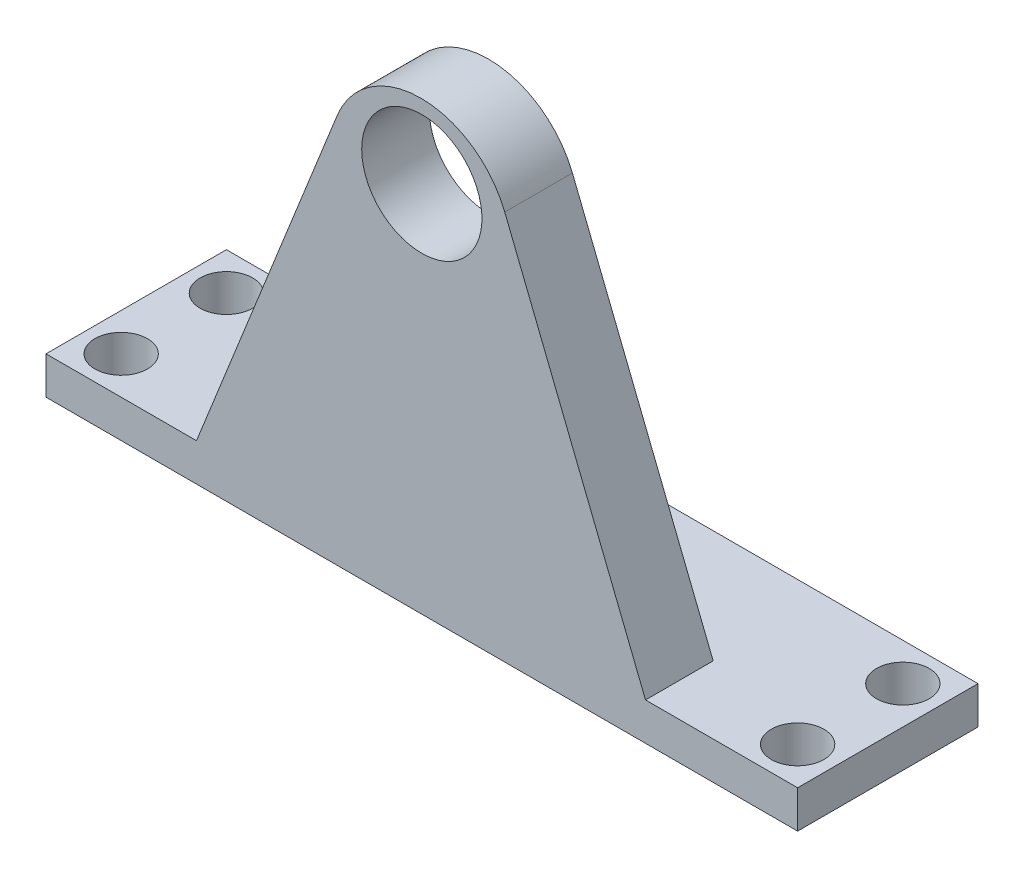
ISO-10303-21;
HEADER;
FILE_DESCRIPTION(('STEP AP214'),'2;1');
FILE_NAME('part.step','',(''),(''),'','','');
FILE_SCHEMA(('AUTOMOTIVE_DESIGN { 1 0 10303 214 1 1 1 1 }'));
ENDSEC;
DATA;
#1=APPLICATION_CONTEXT('core data for automotive mechanical design processes');
#2=APPLICATION_PROTOCOL_DEFINITION('international standard','automotive_design',2000,#1);
#3=PRODUCT_CONTEXT('',#1,'mechanical');
#4=PRODUCT('Part','Part','',(#3));
#5=PRODUCT_RELATED_PRODUCT_CATEGORY('part','',(#4));
#6=PRODUCT_DEFINITION_FORMATION('','',#4);
#7=PRODUCT_DEFINITION_CONTEXT('part definition',#1,'design');
#8=PRODUCT_DEFINITION('design','',#6,#7);
#9=PRODUCT_DEFINITION_SHAPE('','',#8);
#10=(LENGTH_UNIT() NAMED_UNIT(*) SI_UNIT(.MILLI.,.METRE.));
#11=(NAMED_UNIT(*) PLANE_ANGLE_UNIT() SI_UNIT($,.RADIAN.));
#12=(NAMED_UNIT(*) SI_UNIT($,.STERADIAN.) SOLID_ANGLE_UNIT());
#13=UNCERTAINTY_MEASURE_WITH_UNIT(LENGTH_MEASURE(1.E-05),#10,'distance_accuracy_value','');
#14=(GEOMETRIC_REPRESENTATION_CONTEXT(3) GLOBAL_UNCERTAINTY_ASSIGNED_CONTEXT((#13)) GLOBAL_UNIT_ASSIGNED_CONTEXT((#10,
#11,#12)) REPRESENTATION_CONTEXT('',''));
#15=CARTESIAN_POINT('',(0.,0.,0.));
#16=DIRECTION('',(0.,0.,1.));
#17=DIRECTION('',(1.,0.,0.));
#18=AXIS2_PLACEMENT_3D('',#15,#16,#17);
#19=CARTESIAN_POINT('',(0.,5.,0.));
#20=DIRECTION('',(0.,1.,0.));
#21=DIRECTION('',(0.,0.,1.));
#22=AXIS2_PLACEMENT_3D('',#19,#20,#21);
#23=PLANE('',#22);
#24=DIRECTION('',(0.,0.,-1.));
#25=VECTOR('',#24,1.);
#26=CARTESIAN_POINT('',(29.7635160139142,5.,12.));
#27=LINE('',#26,#25);
#28=CARTESIAN_POINT('',(29.7635160139142,5.,12.));
#29=VERTEX_POINT('',#28);
#30=CARTESIAN_POINT('',(29.7635160139142,5.,3.));
#31=VERTEX_POINT('',#30);
#32=EDGE_CURVE('E123',#29,#31,#27,.T.);
#33=ORIENTED_EDGE('',*,*,#32,.F.);
#34=DIRECTION('',(1.,0.,0.));
#35=VECTOR('',#34,1.);
#36=CARTESIAN_POINT('',(-50.,5.,12.));
#37=LINE('',#36,#35);
#38=CARTESIAN_POINT('',(50.,5.,12.));
#39=VERTEX_POINT('',#38);
#40=EDGE_CURVE('E131',#29,#39,#37,.T.);
#41=ORIENTED_EDGE('',*,*,#40,.T.);
#42=DIRECTION('',(0.,0.,-1.));
#43=VECTOR('',#42,1.);
#44=CARTESIAN_POINT('',(50.,5.,-12.));
#45=LINE('',#44,#43);
#46=CARTESIAN_POINT('',(50.,5.,-12.));
#47=VERTEX_POINT('',#46);
#48=EDGE_CURVE('E130',#39,#47,#45,.T.);
#49=ORIENTED_EDGE('',*,*,#48,.T.);
#50=DIRECTION('',(-1.,0.,0.));
#51=VECTOR('',#50,1.);
#52=CARTESIAN_POINT('',(-50.,5.,-12.));
#53=LINE('',#52,#51);
#54=CARTESIAN_POINT('',(-50.,5.,-12.));
#55=VERTEX_POINT('',#54);
#56=EDGE_CURVE('E60',#47,#55,#53,.T.);
#57=ORIENTED_EDGE('',*,*,#56,.T.);
#58=DIRECTION('',(0.,0.,1.));
#59=VECTOR('',#58,1.);
#60=CARTESIAN_POINT('',(-50.,5.,-12.));
#61=LINE('',#60,#59);
#62=CARTESIAN_POINT('',(-50.,5.,12.));
#63=VERTEX_POINT('',#62);
#64=EDGE_CURVE('E128',#55,#63,#61,.T.);
#65=ORIENTED_EDGE('',*,*,#64,.T.);
#66=CARTESIAN_POINT('',(-29.9780216951291,5.,12.));
#67=VERTEX_POINT('',#66);
#68=EDGE_CURVE('E88',#63,#67,#37,.T.);
#69=ORIENTED_EDGE('',*,*,#68,.T.);
#70=DIRECTION('',(0.,0.,-1.));
#71=VECTOR('',#70,1.);
#72=CARTESIAN_POINT('',(-29.9780216951291,5.,12.));
#73=LINE('',#72,#71);
#74=CARTESIAN_POINT('',(-29.9780216951291,5.,3.));
#75=VERTEX_POINT('',#74);
#76=EDGE_CURVE('E119',#67,#75,#73,.T.);
#77=ORIENTED_EDGE('',*,*,#76,.T.);
#78=DIRECTION('',(1.,0.,0.));
#79=VECTOR('',#78,1.);
#80=CARTESIAN_POINT('',(-29.9780216951291,5.,3.));
#81=LINE('',#80,#79);
#82=EDGE_CURVE('E227',#75,#31,#81,.T.);
#83=ORIENTED_EDGE('',*,*,#82,.T.);
#84=EDGE_LOOP('',(#33,#41,#49,#57,#65,#69,#77,#83));
#85=FACE_BOUND('',#84,.T.);
#86=CARTESIAN_POINT('',(44.9999999999999,5.,-7.00000000000003));
#87=DIRECTION('',(0.,1.,0.));
#88=DIRECTION('',(0.,0.,-1.));
#89=AXIS2_PLACEMENT_3D('',#86,#87,#88);
#90=CIRCLE('',#89,3.5);
#91=CARTESIAN_POINT('',(44.9999999999999,5.,-10.5));
#92=VERTEX_POINT('',#91);
#93=EDGE_CURVE('E258',#92,#92,#90,.T.);
#94=ORIENTED_EDGE('',*,*,#93,.F.);
#95=EDGE_LOOP('',(#94));
#96=FACE_BOUND('',#95,.T.);
#97=CARTESIAN_POINT('',(-45.,5.,-7.));
#98=DIRECTION('',(0.,1.,0.));
#99=DIRECTION('',(0.,0.,1.));
#100=AXIS2_PLACEMENT_3D('',#97,#98,#99);
#101=CIRCLE('',#100,3.5);
#102=CARTESIAN_POINT('',(-45.,5.,-3.5));
#103=VERTEX_POINT('',#102);
#104=EDGE_CURVE('E148',#103,#103,#101,.T.);
#105=ORIENTED_EDGE('',*,*,#104,.F.);
#106=EDGE_LOOP('',(#105));
#107=FACE_BOUND('',#106,.T.);
#108=CARTESIAN_POINT('',(-45.,5.,7.));
#109=DIRECTION('',(0.,1.,0.));
#110=DIRECTION('',(0.,0.,1.));
#111=AXIS2_PLACEMENT_3D('',#108,#109,#110);
#112=CIRCLE('',#111,3.5);
#113=CARTESIAN_POINT('',(-45.,5.,10.5));
#114=VERTEX_POINT('',#113);
#115=EDGE_CURVE('E264',#114,#114,#112,.T.);
#116=ORIENTED_EDGE('',*,*,#115,.F.);
#117=EDGE_LOOP('',(#116));
#118=FACE_BOUND('',#117,.T.);
#119=CARTESIAN_POINT('',(45.,5.,6.99999999999997));
#120=DIRECTION('',(0.,1.,0.));
#121=DIRECTION('',(0.,0.,-1.));
#122=AXIS2_PLACEMENT_3D('',#119,#120,#121);
#123=CIRCLE('',#122,3.5);
#124=CARTESIAN_POINT('',(45.,5.,3.49999999999997));
#125=VERTEX_POINT('',#124);
#126=EDGE_CURVE('E243',#125,#125,#123,.T.);
#127=ORIENTED_EDGE('',*,*,#126,.F.);
#128=EDGE_LOOP('',(#127));
#129=FACE_BOUND('',#128,.T.);
#130=ADVANCED_FACE('F34',(#85,#96,#107,#118,#129),#23,.T.);
#131=CARTESIAN_POINT('',(0.,0.,0.));
#132=DIRECTION('',(0.,1.,0.));
#133=DIRECTION('',(0.,0.,1.));
#134=AXIS2_PLACEMENT_3D('',#131,#132,#133);
#135=PLANE('',#134);
#136=CARTESIAN_POINT('',(44.9999999999999,0.,-7.00000000000003));
#137=DIRECTION('',(0.,1.,0.));
#138=DIRECTION('',(0.,0.,-1.));
#139=AXIS2_PLACEMENT_3D('',#136,#137,#138);
#140=CIRCLE('',#139,3.5);
#141=CARTESIAN_POINT('',(44.9999999999999,0.,-10.5));
#142=VERTEX_POINT('',#141);
#143=EDGE_CURVE('E255',#142,#142,#140,.T.);
#144=ORIENTED_EDGE('',*,*,#143,.T.);
#145=EDGE_LOOP('',(#144));
#146=FACE_BOUND('',#145,.T.);
#147=CARTESIAN_POINT('',(-45.,0.,-7.));
#148=DIRECTION('',(0.,1.,0.));
#149=DIRECTION('',(0.,0.,1.));
#150=AXIS2_PLACEMENT_3D('',#147,#148,#149);
#151=CIRCLE('',#150,3.5);
#152=CARTESIAN_POINT('',(-45.,0.,-3.5));
#153=VERTEX_POINT('',#152);
#154=EDGE_CURVE('E267',#153,#153,#151,.T.);
#155=ORIENTED_EDGE('',*,*,#154,.T.);
#156=EDGE_LOOP('',(#155));
#157=FACE_BOUND('',#156,.T.);
#158=DIRECTION('',(0.,0.,1.));
#159=VECTOR('',#158,1.);
#160=CARTESIAN_POINT('',(-50.,0.,-12.));
#161=LINE('',#160,#159);
#162=CARTESIAN_POINT('',(-50.,0.,-12.));
#163=VERTEX_POINT('',#162);
#164=CARTESIAN_POINT('',(-50.,0.,12.));
#165=VERTEX_POINT('',#164);
#166=EDGE_CURVE('E144',#163,#165,#161,.T.);
#167=ORIENTED_EDGE('',*,*,#166,.F.);
#168=DIRECTION('',(-1.,0.,0.));
#169=VECTOR('',#168,1.);
#170=CARTESIAN_POINT('',(-50.,0.,-12.));
#171=LINE('',#170,#169);
#172=CARTESIAN_POINT('',(50.,0.,-12.));
#173=VERTEX_POINT('',#172);
#174=EDGE_CURVE('E81',#173,#163,#171,.T.);
#175=ORIENTED_EDGE('',*,*,#174,.F.);
#176=DIRECTION('',(0.,0.,-1.));
#177=VECTOR('',#176,1.);
#178=CARTESIAN_POINT('',(50.,0.,-12.));
#179=LINE('',#178,#177);
#180=CARTESIAN_POINT('',(50.,0.,12.));
#181=VERTEX_POINT('',#180);
#182=EDGE_CURVE('E150',#181,#173,#179,.T.);
#183=ORIENTED_EDGE('',*,*,#182,.F.);
#184=DIRECTION('',(1.,0.,0.));
#185=VECTOR('',#184,1.);
#186=CARTESIAN_POINT('',(-50.,0.,12.));
#187=LINE('',#186,#185);
#188=EDGE_CURVE('E147',#165,#181,#187,.T.);
#189=ORIENTED_EDGE('',*,*,#188,.F.);
#190=EDGE_LOOP('',(#167,#175,#183,#189));
#191=FACE_BOUND('',#190,.T.);
#192=CARTESIAN_POINT('',(-45.,0.,7.));
#193=DIRECTION('',(0.,1.,0.));
#194=DIRECTION('',(0.,0.,1.));
#195=AXIS2_PLACEMENT_3D('',#192,#193,#194);
#196=CIRCLE('',#195,3.5);
#197=CARTESIAN_POINT('',(-45.,0.,10.5));
#198=VERTEX_POINT('',#197);
#199=EDGE_CURVE('E261',#198,#198,#196,.T.);
#200=ORIENTED_EDGE('',*,*,#199,.T.);
#201=EDGE_LOOP('',(#200));
#202=FACE_BOUND('',#201,.T.);
#203=CARTESIAN_POINT('',(45.,0.,6.99999999999997));
#204=DIRECTION('',(0.,1.,0.));
#205=DIRECTION('',(0.,0.,-1.));
#206=AXIS2_PLACEMENT_3D('',#203,#204,#205);
#207=CIRCLE('',#206,3.5);
#208=CARTESIAN_POINT('',(45.,0.,3.49999999999997));
#209=VERTEX_POINT('',#208);
#210=EDGE_CURVE('E122',#209,#209,#207,.T.);
#211=ORIENTED_EDGE('',*,*,#210,.T.);
#212=EDGE_LOOP('',(#211));
#213=FACE_BOUND('',#212,.T.);
#214=ADVANCED_FACE('F165',(#146,#157,#191,#202,#213),#135,.F.);
#215=CARTESIAN_POINT('',(-50.,5.,-12.));
#216=DIRECTION('',(1.,0.,0.));
#217=DIRECTION('',(0.,0.,-1.));
#218=AXIS2_PLACEMENT_3D('',#215,#216,#217);
#219=PLANE('',#218);
#220=ORIENTED_EDGE('',*,*,#166,.T.);
#221=DIRECTION('',(0.,-1.,0.));
#222=VECTOR('',#221,1.);
#223=CARTESIAN_POINT('',(-50.,5.,12.));
#224=LINE('',#223,#222);
#225=EDGE_CURVE('E11',#63,#165,#224,.T.);
#226=ORIENTED_EDGE('',*,*,#225,.F.);
#227=ORIENTED_EDGE('',*,*,#64,.F.);
#228=DIRECTION('',(0.,-1.,0.));
#229=VECTOR('',#228,1.);
#230=CARTESIAN_POINT('',(-50.,5.,-12.));
#231=LINE('',#230,#229);
#232=EDGE_CURVE('E143',#55,#163,#231,.T.);
#233=ORIENTED_EDGE('',*,*,#232,.T.);
#234=EDGE_LOOP('',(#220,#226,#227,#233));
#235=FACE_BOUND('',#234,.T.);
#236=ADVANCED_FACE('F36',(#235),#219,.F.);
#237=CARTESIAN_POINT('',(-50.,5.,12.));
#238=DIRECTION('',(0.,0.,-1.));
#239=DIRECTION('',(-1.,0.,0.));
#240=AXIS2_PLACEMENT_3D('',#237,#238,#239);
#241=PLANE('',#240);
#242=CARTESIAN_POINT('',(0.,49.5782790739777,12.));
#243=DIRECTION('',(0.,0.,-1.));
#244=DIRECTION('',(-1.,0.,0.));
#245=AXIS2_PLACEMENT_3D('',#242,#243,#244);
#246=CIRCLE('',#245,8.);
#247=CARTESIAN_POINT('',(-8.,49.5782790739777,12.));
#248=VERTEX_POINT('',#247);
#249=EDGE_CURVE('E224',#248,#248,#246,.T.);
#250=ORIENTED_EDGE('',*,*,#249,.T.);
#251=EDGE_LOOP('',(#250));
#252=FACE_BOUND('',#251,.T.);
#253=ORIENTED_EDGE('',*,*,#188,.T.);
#254=DIRECTION('',(0.,-1.,0.));
#255=VECTOR('',#254,1.);
#256=CARTESIAN_POINT('',(50.,5.,12.));
#257=LINE('',#256,#255);
#258=EDGE_CURVE('E43',#39,#181,#257,.T.);
#259=ORIENTED_EDGE('',*,*,#258,.F.);
#260=ORIENTED_EDGE('',*,*,#40,.F.);
#261=DIRECTION('',(-0.371150568871562,0.928572697868248,0.));
#262=VECTOR('',#261,1.);
#263=CARTESIAN_POINT('',(11.0356195338116,51.854874593885,12.));
#264=LINE('',#263,#262);
#265=CARTESIAN_POINT('',(11.0356195338116,51.854874593885,12.));
#266=VERTEX_POINT('',#265);
#267=EDGE_CURVE('E115',#29,#266,#264,.T.);
#268=ORIENTED_EDGE('',*,*,#267,.T.);
#269=CARTESIAN_POINT('',(-0.10725284060744,47.4010677674266,12.));
#270=DIRECTION('',(0.,0.,1.));
#271=DIRECTION('',(1.,0.,0.));
#272=AXIS2_PLACEMENT_3D('',#269,#270,#271);
#273=CIRCLE('',#272,12.);
#274=CARTESIAN_POINT('',(-11.2501252150265,51.854874593885,12.));
#275=VERTEX_POINT('',#274);
#276=EDGE_CURVE('E113',#266,#275,#273,.T.);
#277=ORIENTED_EDGE('',*,*,#276,.T.);
#278=DIRECTION('',(-0.371150568871562,-0.928572697868248,0.));
#279=VECTOR('',#278,1.);
#280=CARTESIAN_POINT('',(-29.9780216951291,5.,12.));
#281=LINE('',#280,#279);
#282=EDGE_CURVE('E110',#275,#67,#281,.T.);
#283=ORIENTED_EDGE('',*,*,#282,.T.);
#284=ORIENTED_EDGE('',*,*,#68,.F.);
#285=ORIENTED_EDGE('',*,*,#225,.T.);
#286=EDGE_LOOP('',(#253,#259,#260,#268,#277,#283,#284,#285));
#287=FACE_BOUND('',#286,.T.);
#288=ADVANCED_FACE('F111',(#252,#287),#241,.F.);
#289=CARTESIAN_POINT('',(50.,5.,-12.));
#290=DIRECTION('',(-1.,0.,0.));
#291=DIRECTION('',(0.,0.,1.));
#292=AXIS2_PLACEMENT_3D('',#289,#290,#291);
#293=PLANE('',#292);
#294=ORIENTED_EDGE('',*,*,#182,.T.);
#295=DIRECTION('',(0.,-1.,0.));
#296=VECTOR('',#295,1.);
#297=CARTESIAN_POINT('',(50.,5.,-12.));
#298=LINE('',#297,#296);
#299=EDGE_CURVE('E154',#47,#173,#298,.T.);
#300=ORIENTED_EDGE('',*,*,#299,.F.);
#301=ORIENTED_EDGE('',*,*,#48,.F.);
#302=ORIENTED_EDGE('',*,*,#258,.T.);
#303=EDGE_LOOP('',(#294,#300,#301,#302));
#304=FACE_BOUND('',#303,.T.);
#305=ADVANCED_FACE('F160',(#304),#293,.F.);
#306=CARTESIAN_POINT('',(-50.,5.,-12.));
#307=DIRECTION('',(0.,0.,1.));
#308=DIRECTION('',(1.,0.,0.));
#309=AXIS2_PLACEMENT_3D('',#306,#307,#308);
#310=PLANE('',#309);
#311=ORIENTED_EDGE('',*,*,#174,.T.);
#312=ORIENTED_EDGE('',*,*,#232,.F.);
#313=ORIENTED_EDGE('',*,*,#56,.F.);
#314=ORIENTED_EDGE('',*,*,#299,.T.);
#315=EDGE_LOOP('',(#311,#312,#313,#314));
#316=FACE_BOUND('',#315,.T.);
#317=ADVANCED_FACE('F168',(#316),#310,.F.);
#318=CARTESIAN_POINT('',(-45.,5.,-7.));
#319=DIRECTION('',(0.,-1.,0.));
#320=DIRECTION('',(0.,0.,-1.));
#321=AXIS2_PLACEMENT_3D('',#318,#319,#320);
#322=CYLINDRICAL_SURFACE('',#321,3.5);
#323=ORIENTED_EDGE('',*,*,#104,.T.);
#324=EDGE_LOOP('',(#323));
#325=FACE_BOUND('',#324,.T.);
#326=ORIENTED_EDGE('',*,*,#154,.F.);
#327=EDGE_LOOP('',(#326));
#328=FACE_BOUND('',#327,.T.);
#329=ADVANCED_FACE('F170',(#325,#328),#322,.F.);
#330=CARTESIAN_POINT('',(-45.,5.,7.));
#331=DIRECTION('',(0.,-1.,0.));
#332=DIRECTION('',(0.,0.,-1.));
#333=AXIS2_PLACEMENT_3D('',#330,#331,#332);
#334=CYLINDRICAL_SURFACE('',#333,3.5);
#335=ORIENTED_EDGE('',*,*,#115,.T.);
#336=EDGE_LOOP('',(#335));
#337=FACE_BOUND('',#336,.T.);
#338=ORIENTED_EDGE('',*,*,#199,.F.);
#339=EDGE_LOOP('',(#338));
#340=FACE_BOUND('',#339,.T.);
#341=ADVANCED_FACE('F176',(#337,#340),#334,.F.);
#342=CARTESIAN_POINT('',(44.9999999999999,5.,-7.00000000000003));
#343=DIRECTION('',(0.,-1.,0.));
#344=DIRECTION('',(0.,0.,-1.));
#345=AXIS2_PLACEMENT_3D('',#342,#343,#344);
#346=CYLINDRICAL_SURFACE('',#345,3.5);
#347=ORIENTED_EDGE('',*,*,#93,.T.);
#348=EDGE_LOOP('',(#347));
#349=FACE_BOUND('',#348,.T.);
#350=ORIENTED_EDGE('',*,*,#143,.F.);
#351=EDGE_LOOP('',(#350));
#352=FACE_BOUND('',#351,.T.);
#353=ADVANCED_FACE('F190',(#349,#352),#346,.F.);
#354=CARTESIAN_POINT('',(45.,5.,6.99999999999997));
#355=DIRECTION('',(0.,-1.,0.));
#356=DIRECTION('',(0.,0.,-1.));
#357=AXIS2_PLACEMENT_3D('',#354,#355,#356);
#358=CYLINDRICAL_SURFACE('',#357,3.5);
#359=ORIENTED_EDGE('',*,*,#126,.T.);
#360=EDGE_LOOP('',(#359));
#361=FACE_BOUND('',#360,.T.);
#362=ORIENTED_EDGE('',*,*,#210,.F.);
#363=EDGE_LOOP('',(#362));
#364=FACE_BOUND('',#363,.T.);
#365=ADVANCED_FACE('F194',(#361,#364),#358,.F.);
#366=CARTESIAN_POINT('',(-29.9780216951291,5.,12.));
#367=DIRECTION('',(0.928572697868248,-0.371150568871562,0.));
#368=DIRECTION('',(0.371150568871562,0.928572697868248,0.));
#369=AXIS2_PLACEMENT_3D('',#366,#367,#368);
#370=PLANE('',#369);
#371=DIRECTION('',(-0.371150568871562,-0.928572697868248,0.));
#372=VECTOR('',#371,1.);
#373=CARTESIAN_POINT('',(-29.9780216951291,5.,3.));
#374=LINE('',#373,#372);
#375=CARTESIAN_POINT('',(-11.2501252150265,51.854874593885,3.));
#376=VERTEX_POINT('',#375);
#377=EDGE_CURVE('E51',#376,#75,#374,.T.);
#378=ORIENTED_EDGE('',*,*,#377,.T.);
#379=ORIENTED_EDGE('',*,*,#76,.F.);
#380=ORIENTED_EDGE('',*,*,#282,.F.);
#381=DIRECTION('',(0.,0.,-1.));
#382=VECTOR('',#381,1.);
#383=CARTESIAN_POINT('',(-11.2501252150265,51.854874593885,12.));
#384=LINE('',#383,#382);
#385=EDGE_CURVE('E231',#275,#376,#384,.T.);
#386=ORIENTED_EDGE('',*,*,#385,.T.);
#387=EDGE_LOOP('',(#378,#379,#380,#386));
#388=FACE_BOUND('',#387,.T.);
#389=ADVANCED_FACE('F120',(#388),#370,.F.);
#390=CARTESIAN_POINT('',(11.0356195338116,51.854874593885,12.));
#391=DIRECTION('',(-0.928572697868248,-0.371150568871562,0.));
#392=DIRECTION('',(0.371150568871562,-0.928572697868248,0.));
#393=AXIS2_PLACEMENT_3D('',#390,#391,#392);
#394=PLANE('',#393);
#395=DIRECTION('',(-0.371150568871562,0.928572697868248,0.));
#396=VECTOR('',#395,1.);
#397=CARTESIAN_POINT('',(11.0356195338116,51.854874593885,3.));
#398=LINE('',#397,#396);
#399=CARTESIAN_POINT('',(11.0356195338116,51.854874593885,3.));
#400=VERTEX_POINT('',#399);
#401=EDGE_CURVE('E234',#31,#400,#398,.T.);
#402=ORIENTED_EDGE('',*,*,#401,.T.);
#403=DIRECTION('',(0.,0.,-1.));
#404=VECTOR('',#403,1.);
#405=CARTESIAN_POINT('',(11.0356195338116,51.854874593885,12.));
#406=LINE('',#405,#404);
#407=EDGE_CURVE('E238',#266,#400,#406,.T.);
#408=ORIENTED_EDGE('',*,*,#407,.F.);
#409=ORIENTED_EDGE('',*,*,#267,.F.);
#410=ORIENTED_EDGE('',*,*,#32,.T.);
#411=EDGE_LOOP('',(#402,#408,#409,#410));
#412=FACE_BOUND('',#411,.T.);
#413=ADVANCED_FACE('F201',(#412),#394,.F.);
#414=CARTESIAN_POINT('',(-0.10725284060744,47.4010677674266,12.));
#415=DIRECTION('',(0.,0.,-1.));
#416=DIRECTION('',(-1.,0.,0.));
#417=AXIS2_PLACEMENT_3D('',#414,#415,#416);
#418=CYLINDRICAL_SURFACE('',#417,12.);
#419=CARTESIAN_POINT('',(-0.10725284060744,47.4010677674266,3.));
#420=DIRECTION('',(0.,0.,1.));
#421=DIRECTION('',(1.,0.,0.));
#422=AXIS2_PLACEMENT_3D('',#419,#420,#421);
#423=CIRCLE('',#422,12.);
#424=EDGE_CURVE('E116',#400,#376,#423,.T.);
#425=ORIENTED_EDGE('',*,*,#424,.T.);
#426=ORIENTED_EDGE('',*,*,#385,.F.);
#427=ORIENTED_EDGE('',*,*,#276,.F.);
#428=ORIENTED_EDGE('',*,*,#407,.T.);
#429=EDGE_LOOP('',(#425,#426,#427,#428));
#430=FACE_BOUND('',#429,.T.);
#431=ADVANCED_FACE('F204',(#430),#418,.T.);
#432=CARTESIAN_POINT('',(-0.10725284060744,47.4010677674266,3.));
#433=DIRECTION('',(0.,0.,1.));
#434=DIRECTION('',(1.,0.,0.));
#435=AXIS2_PLACEMENT_3D('',#432,#433,#434);
#436=PLANE('',#435);
#437=CARTESIAN_POINT('',(0.,49.5782790739777,3.));
#438=DIRECTION('',(0.,0.,-1.));
#439=DIRECTION('',(-1.,0.,0.));
#440=AXIS2_PLACEMENT_3D('',#437,#438,#439);
#441=CIRCLE('',#440,8.);
#442=CARTESIAN_POINT('',(-8.,49.5782790739777,3.));
#443=VERTEX_POINT('',#442);
#444=EDGE_CURVE('E221',#443,#443,#441,.T.);
#445=ORIENTED_EDGE('',*,*,#444,.F.);
#446=EDGE_LOOP('',(#445));
#447=FACE_BOUND('',#446,.T.);
#448=ORIENTED_EDGE('',*,*,#377,.F.);
#449=ORIENTED_EDGE('',*,*,#424,.F.);
#450=ORIENTED_EDGE('',*,*,#401,.F.);
#451=ORIENTED_EDGE('',*,*,#82,.F.);
#452=EDGE_LOOP('',(#448,#449,#450,#451));
#453=FACE_BOUND('',#452,.T.);
#454=ADVANCED_FACE('F208',(#447,#453),#436,.F.);
#455=CARTESIAN_POINT('',(0.,49.5782790739777,12.00005));
#456=DIRECTION('',(0.,0.,-1.));
#457=DIRECTION('',(-1.,0.,0.));
#458=AXIS2_PLACEMENT_3D('',#455,#456,#457);
#459=CYLINDRICAL_SURFACE('',#458,8.);
#460=ORIENTED_EDGE('',*,*,#444,.T.);
#461=EDGE_LOOP('',(#460));
#462=FACE_BOUND('',#461,.T.);
#463=ORIENTED_EDGE('',*,*,#249,.F.);
#464=EDGE_LOOP('',(#463));
#465=FACE_BOUND('',#464,.T.);
#466=ADVANCED_FACE('F212',(#462,#465),#459,.F.);
#467=CLOSED_SHELL('',(#130,#214,#236,#288,#305,#317,#329,#341,#353,#365,#389,#413,#431,#454,#466));
#468=MANIFOLD_SOLID_BREP('B2',#467);
#469=ADVANCED_BREP_SHAPE_REPRESENTATION('',(#18,#468),#14);
#470=SHAPE_DEFINITION_REPRESENTATION(#9,#469);
ENDSEC;
END-ISO-10303-21;
